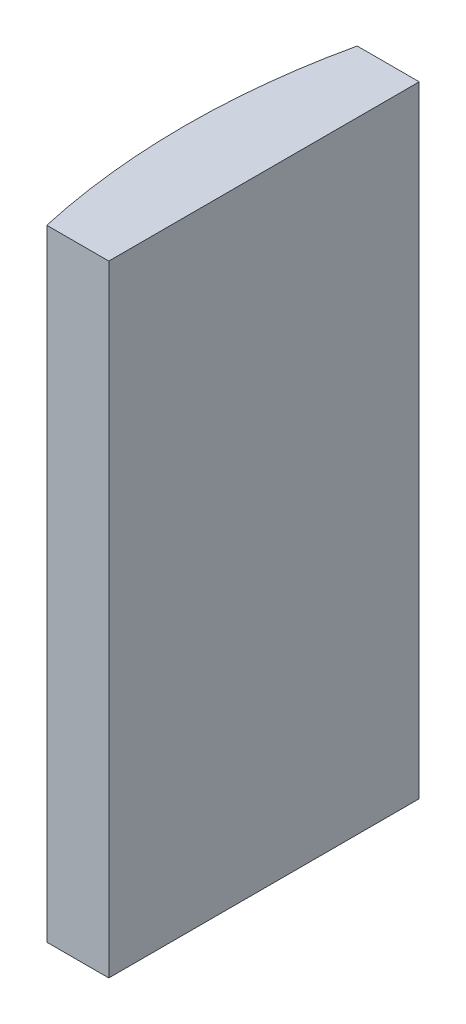
ISO-10303-21;
HEADER;
FILE_DESCRIPTION(('STEP AP214'),'2;1');
FILE_NAME('part.step','',(''),(''),'','','');
FILE_SCHEMA(('AUTOMOTIVE_DESIGN { 1 0 10303 214 1 1 1 1 }'));
ENDSEC;
DATA;
#1=APPLICATION_CONTEXT('core data for automotive mechanical design processes');
#2=APPLICATION_PROTOCOL_DEFINITION('international standard','automotive_design',2000,#1);
#3=PRODUCT_CONTEXT('',#1,'mechanical');
#4=PRODUCT('Part','Part','',(#3));
#5=PRODUCT_RELATED_PRODUCT_CATEGORY('part','',(#4));
#6=PRODUCT_DEFINITION_FORMATION('','',#4);
#7=PRODUCT_DEFINITION_CONTEXT('part definition',#1,'design');
#8=PRODUCT_DEFINITION('design','',#6,#7);
#9=PRODUCT_DEFINITION_SHAPE('','',#8);
#10=(LENGTH_UNIT() NAMED_UNIT(*) SI_UNIT(.MILLI.,.METRE.));
#11=(NAMED_UNIT(*) PLANE_ANGLE_UNIT() SI_UNIT($,.RADIAN.));
#12=(NAMED_UNIT(*) SI_UNIT($,.STERADIAN.) SOLID_ANGLE_UNIT());
#13=UNCERTAINTY_MEASURE_WITH_UNIT(LENGTH_MEASURE(1.E-05),#10,'distance_accuracy_value','');
#14=(GEOMETRIC_REPRESENTATION_CONTEXT(3) GLOBAL_UNCERTAINTY_ASSIGNED_CONTEXT((#13)) GLOBAL_UNIT_ASSIGNED_CONTEXT((#10,
#11,#12)) REPRESENTATION_CONTEXT('',''));
#15=CARTESIAN_POINT('',(0.,0.,0.));
#16=DIRECTION('',(0.,0.,1.));
#17=DIRECTION('',(1.,0.,0.));
#18=AXIS2_PLACEMENT_3D('',#15,#16,#17);
#19=CARTESIAN_POINT('',(4.35520433485127,20.,0.));
#20=DIRECTION('',(0.,-1.,0.));
#21=DIRECTION('',(0.,0.,-1.));
#22=AXIS2_PLACEMENT_3D('',#19,#20,#21);
#23=CYLINDRICAL_SURFACE('',#22,22.92);
#24=CARTESIAN_POINT('',(4.35520433485127,0.,0.));
#25=DIRECTION('',(0.,1.,0.));
#26=DIRECTION('',(0.,0.,1.));
#27=AXIS2_PLACEMENT_3D('',#24,#25,#26);
#28=CIRCLE('',#27,22.92);
#29=CARTESIAN_POINT('',(-18.0127727752944,0.,-5.));
#30=VERTEX_POINT('',#29);
#31=CARTESIAN_POINT('',(-18.0127727752944,0.,5.));
#32=VERTEX_POINT('',#31);
#33=EDGE_CURVE('E100',#30,#32,#28,.T.);
#34=ORIENTED_EDGE('',*,*,#33,.T.);
#35=DIRECTION('',(0.,-1.,0.));
#36=VECTOR('',#35,1.);
#37=CARTESIAN_POINT('',(-18.0127727752944,20.,5.));
#38=LINE('',#37,#36);
#39=CARTESIAN_POINT('',(-18.0127727752944,20.,5.));
#40=VERTEX_POINT('',#39);
#41=EDGE_CURVE('E11',#40,#32,#38,.T.);
#42=ORIENTED_EDGE('',*,*,#41,.F.);
#43=CARTESIAN_POINT('',(4.35520433485127,20.,0.));
#44=DIRECTION('',(0.,1.,0.));
#45=DIRECTION('',(0.,0.,1.));
#46=AXIS2_PLACEMENT_3D('',#43,#44,#45);
#47=CIRCLE('',#46,22.92);
#48=CARTESIAN_POINT('',(-18.0127727752944,20.,-5.));
#49=VERTEX_POINT('',#48);
#50=EDGE_CURVE('E88',#49,#40,#47,.T.);
#51=ORIENTED_EDGE('',*,*,#50,.F.);
#52=DIRECTION('',(0.,-1.,0.));
#53=VECTOR('',#52,1.);
#54=CARTESIAN_POINT('',(-18.0127727752944,20.,-5.));
#55=LINE('',#54,#53);
#56=EDGE_CURVE('E96',#49,#30,#55,.T.);
#57=ORIENTED_EDGE('',*,*,#56,.T.);
#58=EDGE_LOOP('',(#34,#42,#51,#57));
#59=FACE_BOUND('',#58,.T.);
#60=ADVANCED_FACE('F37',(#59),#23,.T.);
#61=CARTESIAN_POINT('',(-18.0127727752944,20.,5.));
#62=DIRECTION('',(0.,0.,-1.));
#63=DIRECTION('',(-1.,0.,0.));
#64=AXIS2_PLACEMENT_3D('',#61,#62,#63);
#65=PLANE('',#64);
#66=DIRECTION('',(1.,0.,0.));
#67=VECTOR('',#66,1.);
#68=CARTESIAN_POINT('',(-18.0127727752944,0.,5.));
#69=LINE('',#68,#67);
#70=CARTESIAN_POINT('',(-16.0147956651487,0.,5.));
#71=VERTEX_POINT('',#70);
#72=EDGE_CURVE('E92',#32,#71,#69,.T.);
#73=ORIENTED_EDGE('',*,*,#72,.T.);
#74=DIRECTION('',(0.,-1.,0.));
#75=VECTOR('',#74,1.);
#76=CARTESIAN_POINT('',(-16.0147956651487,20.,5.));
#77=LINE('',#76,#75);
#78=CARTESIAN_POINT('',(-16.0147956651487,20.,5.));
#79=VERTEX_POINT('',#78);
#80=EDGE_CURVE('E45',#79,#71,#77,.T.);
#81=ORIENTED_EDGE('',*,*,#80,.F.);
#82=DIRECTION('',(1.,0.,0.));
#83=VECTOR('',#82,1.);
#84=CARTESIAN_POINT('',(-18.0127727752944,20.,5.));
#85=LINE('',#84,#83);
#86=EDGE_CURVE('E83',#40,#79,#85,.T.);
#87=ORIENTED_EDGE('',*,*,#86,.F.);
#88=ORIENTED_EDGE('',*,*,#41,.T.);
#89=EDGE_LOOP('',(#73,#81,#87,#88));
#90=FACE_BOUND('',#89,.T.);
#91=ADVANCED_FACE('F91',(#90),#65,.F.);
#92=CARTESIAN_POINT('',(-16.0147956651487,20.,-5.));
#93=DIRECTION('',(-1.,0.,0.));
#94=DIRECTION('',(0.,0.,1.));
#95=AXIS2_PLACEMENT_3D('',#92,#93,#94);
#96=PLANE('',#95);
#97=DIRECTION('',(0.,0.,-1.));
#98=VECTOR('',#97,1.);
#99=CARTESIAN_POINT('',(-16.0147956651487,0.,-5.));
#100=LINE('',#99,#98);
#101=CARTESIAN_POINT('',(-16.0147956651487,0.,-5.));
#102=VERTEX_POINT('',#101);
#103=EDGE_CURVE('E70',#71,#102,#100,.T.);
#104=ORIENTED_EDGE('',*,*,#103,.T.);
#105=DIRECTION('',(0.,-1.,0.));
#106=VECTOR('',#105,1.);
#107=CARTESIAN_POINT('',(-16.0147956651487,20.,-5.));
#108=LINE('',#107,#106);
#109=CARTESIAN_POINT('',(-16.0147956651487,20.,-5.));
#110=VERTEX_POINT('',#109);
#111=EDGE_CURVE('E93',#110,#102,#108,.T.);
#112=ORIENTED_EDGE('',*,*,#111,.F.);
#113=DIRECTION('',(0.,0.,-1.));
#114=VECTOR('',#113,1.);
#115=CARTESIAN_POINT('',(-16.0147956651487,20.,-5.));
#116=LINE('',#115,#114);
#117=EDGE_CURVE('E86',#79,#110,#116,.T.);
#118=ORIENTED_EDGE('',*,*,#117,.F.);
#119=ORIENTED_EDGE('',*,*,#80,.T.);
#120=EDGE_LOOP('',(#104,#112,#118,#119));
#121=FACE_BOUND('',#120,.T.);
#122=ADVANCED_FACE('F94',(#121),#96,.F.);
#123=CARTESIAN_POINT('',(-18.0127727752944,20.,-5.));
#124=DIRECTION('',(0.,0.,1.));
#125=DIRECTION('',(1.,0.,0.));
#126=AXIS2_PLACEMENT_3D('',#123,#124,#125);
#127=PLANE('',#126);
#128=DIRECTION('',(-1.,0.,0.));
#129=VECTOR('',#128,1.);
#130=CARTESIAN_POINT('',(-18.0127727752944,0.,-5.));
#131=LINE('',#130,#129);
#132=EDGE_CURVE('E76',#102,#30,#131,.T.);
#133=ORIENTED_EDGE('',*,*,#132,.T.);
#134=ORIENTED_EDGE('',*,*,#56,.F.);
#135=DIRECTION('',(-1.,0.,0.));
#136=VECTOR('',#135,1.);
#137=CARTESIAN_POINT('',(-18.0127727752944,20.,-5.));
#138=LINE('',#137,#136);
#139=EDGE_CURVE('E53',#110,#49,#138,.T.);
#140=ORIENTED_EDGE('',*,*,#139,.F.);
#141=ORIENTED_EDGE('',*,*,#111,.T.);
#142=EDGE_LOOP('',(#133,#134,#140,#141));
#143=FACE_BOUND('',#142,.T.);
#144=ADVANCED_FACE('F107',(#143),#127,.F.);
#145=CARTESIAN_POINT('',(4.35520433485127,20.,0.));
#146=DIRECTION('',(0.,1.,0.));
#147=DIRECTION('',(0.,0.,1.));
#148=AXIS2_PLACEMENT_3D('',#145,#146,#147);
#149=PLANE('',#148);
#150=ORIENTED_EDGE('',*,*,#50,.T.);
#151=ORIENTED_EDGE('',*,*,#86,.T.);
#152=ORIENTED_EDGE('',*,*,#117,.T.);
#153=ORIENTED_EDGE('',*,*,#139,.T.);
#154=EDGE_LOOP('',(#150,#151,#152,#153));
#155=FACE_BOUND('',#154,.T.);
#156=ADVANCED_FACE('F84',(#155),#149,.T.);
#157=CARTESIAN_POINT('',(4.35520433485127,0.,0.));
#158=DIRECTION('',(0.,1.,0.));
#159=DIRECTION('',(0.,0.,1.));
#160=AXIS2_PLACEMENT_3D('',#157,#158,#159);
#161=PLANE('',#160);
#162=ORIENTED_EDGE('',*,*,#33,.F.);
#163=ORIENTED_EDGE('',*,*,#132,.F.);
#164=ORIENTED_EDGE('',*,*,#103,.F.);
#165=ORIENTED_EDGE('',*,*,#72,.F.);
#166=EDGE_LOOP('',(#162,#163,#164,#165));
#167=FACE_BOUND('',#166,.T.);
#168=ADVANCED_FACE('F110',(#167),#161,.F.);
#169=CLOSED_SHELL('',(#60,#91,#122,#144,#156,#168));
#170=MANIFOLD_SOLID_BREP('B2',#169);
#171=ADVANCED_BREP_SHAPE_REPRESENTATION('',(#18,#170),#14);
#172=SHAPE_DEFINITION_REPRESENTATION(#9,#171);
ENDSEC;
END-ISO-10303-21;
